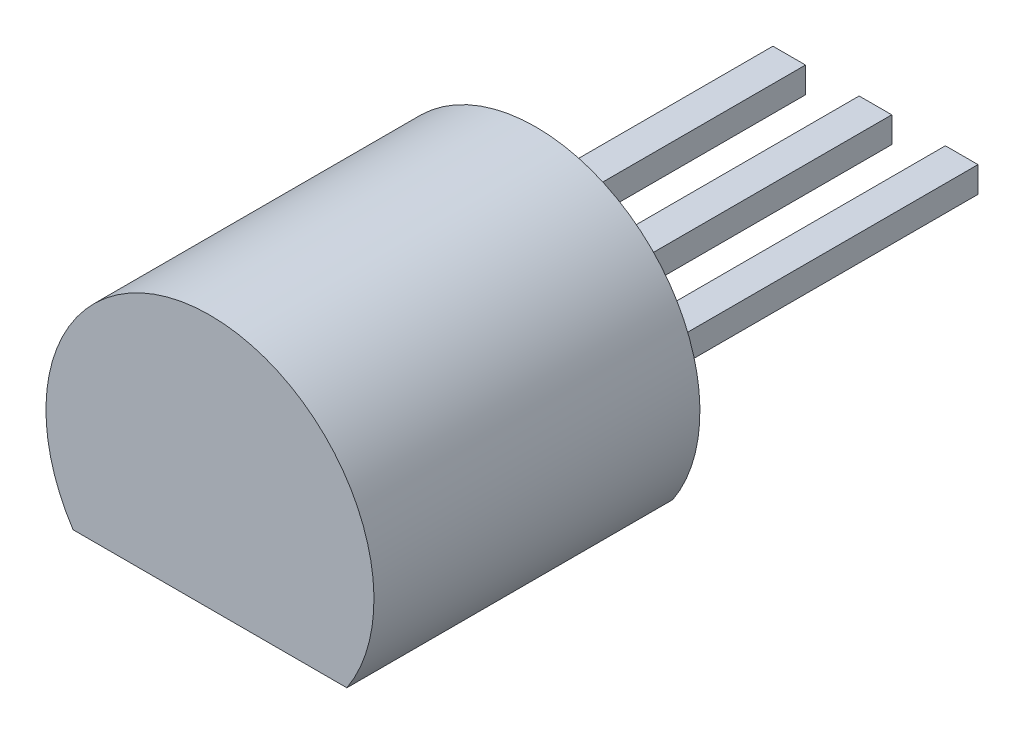
ISO-10303-21;
HEADER;
FILE_DESCRIPTION(('STEP AP214'),'2;1');
FILE_NAME('part.step','',(''),(''),'','','');
FILE_SCHEMA(('AUTOMOTIVE_DESIGN { 1 0 10303 214 1 1 1 1 }'));
ENDSEC;
DATA;
#1=APPLICATION_CONTEXT('core data for automotive mechanical design processes');
#2=APPLICATION_PROTOCOL_DEFINITION('international standard','automotive_design',2000,#1);
#3=PRODUCT_CONTEXT('',#1,'mechanical');
#4=PRODUCT('Part','Part','',(#3));
#5=PRODUCT_RELATED_PRODUCT_CATEGORY('part','',(#4));
#6=PRODUCT_DEFINITION_FORMATION('','',#4);
#7=PRODUCT_DEFINITION_CONTEXT('part definition',#1,'design');
#8=PRODUCT_DEFINITION('design','',#6,#7);
#9=PRODUCT_DEFINITION_SHAPE('','',#8);
#10=(LENGTH_UNIT() NAMED_UNIT(*) SI_UNIT(.MILLI.,.METRE.));
#11=(NAMED_UNIT(*) PLANE_ANGLE_UNIT() SI_UNIT($,.RADIAN.));
#12=(NAMED_UNIT(*) SI_UNIT($,.STERADIAN.) SOLID_ANGLE_UNIT());
#13=UNCERTAINTY_MEASURE_WITH_UNIT(LENGTH_MEASURE(1.E-05),#10,'distance_accuracy_value','');
#14=(GEOMETRIC_REPRESENTATION_CONTEXT(3) GLOBAL_UNCERTAINTY_ASSIGNED_CONTEXT((#13)) GLOBAL_UNIT_ASSIGNED_CONTEXT((#10,
#11,#12)) REPRESENTATION_CONTEXT('',''));
#15=CARTESIAN_POINT('',(0.,0.,0.));
#16=DIRECTION('',(0.,0.,1.));
#17=DIRECTION('',(1.,0.,0.));
#18=AXIS2_PLACEMENT_3D('',#15,#16,#17);
#19=CARTESIAN_POINT('',(1.51,0.19,2.5));
#20=DIRECTION('',(-1.,0.,0.));
#21=DIRECTION('',(0.,0.,1.));
#22=AXIS2_PLACEMENT_3D('',#19,#20,#21);
#23=PLANE('',#22);
#24=DIRECTION('',(0.,0.,1.));
#25=VECTOR('',#24,1.);
#26=CARTESIAN_POINT('',(1.51,-0.19,2.5));
#27=LINE('',#26,#25);
#28=CARTESIAN_POINT('',(1.51,-0.19,2.5));
#29=VERTEX_POINT('',#28);
#30=CARTESIAN_POINT('',(1.51,-0.19,-2.5));
#31=VERTEX_POINT('',#30);
#32=EDGE_CURVE('E125',#29,#31,#27,.F.);
#33=ORIENTED_EDGE('',*,*,#32,.T.);
#34=DIRECTION('',(0.,1.,0.));
#35=VECTOR('',#34,1.);
#36=CARTESIAN_POINT('',(1.51,0.19,-2.5));
#37=LINE('',#36,#35);
#38=CARTESIAN_POINT('',(1.51,0.19,-2.5));
#39=VERTEX_POINT('',#38);
#40=EDGE_CURVE('E227',#31,#39,#37,.T.);
#41=ORIENTED_EDGE('',*,*,#40,.T.);
#42=DIRECTION('',(0.,0.,-1.));
#43=VECTOR('',#42,1.);
#44=CARTESIAN_POINT('',(1.51,0.19,2.5));
#45=LINE('',#44,#43);
#46=CARTESIAN_POINT('',(1.51,0.19,2.5));
#47=VERTEX_POINT('',#46);
#48=EDGE_CURVE('E128',#39,#47,#45,.F.);
#49=ORIENTED_EDGE('',*,*,#48,.T.);
#50=DIRECTION('',(0.,1.,0.));
#51=VECTOR('',#50,1.);
#52=CARTESIAN_POINT('',(1.51,0.19,2.5));
#53=LINE('',#52,#51);
#54=EDGE_CURVE('E122',#29,#47,#53,.T.);
#55=ORIENTED_EDGE('',*,*,#54,.F.);
#56=EDGE_LOOP('',(#33,#41,#49,#55));
#57=FACE_BOUND('',#56,.T.);
#58=ADVANCED_FACE('F17',(#57),#23,.F.);
#59=CARTESIAN_POINT('',(0.24,0.19,2.5));
#60=DIRECTION('',(-1.,0.,0.));
#61=DIRECTION('',(0.,0.,1.));
#62=AXIS2_PLACEMENT_3D('',#59,#60,#61);
#63=PLANE('',#62);
#64=DIRECTION('',(0.,0.,1.));
#65=VECTOR('',#64,1.);
#66=CARTESIAN_POINT('',(0.24,-0.19,2.5));
#67=LINE('',#66,#65);
#68=CARTESIAN_POINT('',(0.24,-0.19,2.5));
#69=VERTEX_POINT('',#68);
#70=CARTESIAN_POINT('',(0.24,-0.19,-2.5));
#71=VERTEX_POINT('',#70);
#72=EDGE_CURVE('E219',#69,#71,#67,.F.);
#73=ORIENTED_EDGE('',*,*,#72,.T.);
#74=DIRECTION('',(0.,1.,0.));
#75=VECTOR('',#74,1.);
#76=CARTESIAN_POINT('',(0.24,0.19,-2.5));
#77=LINE('',#76,#75);
#78=CARTESIAN_POINT('',(0.24,0.19,-2.5));
#79=VERTEX_POINT('',#78);
#80=EDGE_CURVE('E211',#71,#79,#77,.T.);
#81=ORIENTED_EDGE('',*,*,#80,.T.);
#82=DIRECTION('',(0.,0.,-1.));
#83=VECTOR('',#82,1.);
#84=CARTESIAN_POINT('',(0.24,0.19,2.5));
#85=LINE('',#84,#83);
#86=CARTESIAN_POINT('',(0.24,0.19,2.5));
#87=VERTEX_POINT('',#86);
#88=EDGE_CURVE('E205',#79,#87,#85,.F.);
#89=ORIENTED_EDGE('',*,*,#88,.T.);
#90=DIRECTION('',(0.,1.,0.));
#91=VECTOR('',#90,1.);
#92=CARTESIAN_POINT('',(0.24,0.19,2.5));
#93=LINE('',#92,#91);
#94=EDGE_CURVE('E131',#69,#87,#93,.T.);
#95=ORIENTED_EDGE('',*,*,#94,.F.);
#96=EDGE_LOOP('',(#73,#81,#89,#95));
#97=FACE_BOUND('',#96,.T.);
#98=ADVANCED_FACE('F287',(#97),#63,.F.);
#99=CARTESIAN_POINT('',(2.3,0.19,2.5));
#100=DIRECTION('',(0.,-1.,0.));
#101=DIRECTION('',(0.,0.,-1.));
#102=AXIS2_PLACEMENT_3D('',#99,#100,#101);
#103=PLANE('',#102);
#104=DIRECTION('',(0.,0.,1.));
#105=VECTOR('',#104,1.);
#106=CARTESIAN_POINT('',(2.78,0.19,2.5));
#107=LINE('',#106,#105);
#108=CARTESIAN_POINT('',(2.78,0.19,2.5));
#109=VERTEX_POINT('',#108);
#110=CARTESIAN_POINT('',(2.78,0.19,-2.5));
#111=VERTEX_POINT('',#110);
#112=EDGE_CURVE('E201',#109,#111,#107,.F.);
#113=ORIENTED_EDGE('',*,*,#112,.T.);
#114=DIRECTION('',(1.,0.,0.));
#115=VECTOR('',#114,1.);
#116=CARTESIAN_POINT('',(2.3,0.19,-2.5));
#117=LINE('',#116,#115);
#118=CARTESIAN_POINT('',(2.3,0.19,-2.5));
#119=VERTEX_POINT('',#118);
#120=EDGE_CURVE('E193',#111,#119,#117,.F.);
#121=ORIENTED_EDGE('',*,*,#120,.T.);
#122=DIRECTION('',(0.,0.,-1.));
#123=VECTOR('',#122,1.);
#124=CARTESIAN_POINT('',(2.3,0.19,2.5));
#125=LINE('',#124,#123);
#126=CARTESIAN_POINT('',(2.3,0.19,2.5));
#127=VERTEX_POINT('',#126);
#128=EDGE_CURVE('E187',#119,#127,#125,.F.);
#129=ORIENTED_EDGE('',*,*,#128,.T.);
#130=DIRECTION('',(1.,0.,0.));
#131=VECTOR('',#130,1.);
#132=CARTESIAN_POINT('',(2.3,0.19,2.5));
#133=LINE('',#132,#131);
#134=EDGE_CURVE('E145',#109,#127,#133,.F.);
#135=ORIENTED_EDGE('',*,*,#134,.F.);
#136=EDGE_LOOP('',(#113,#121,#129,#135));
#137=FACE_BOUND('',#136,.T.);
#138=ADVANCED_FACE('F285',(#137),#103,.F.);
#139=CARTESIAN_POINT('',(1.51,-0.19,2.5));
#140=DIRECTION('',(0.,1.,0.));
#141=DIRECTION('',(0.,0.,1.));
#142=AXIS2_PLACEMENT_3D('',#139,#140,#141);
#143=PLANE('',#142);
#144=DIRECTION('',(0.,0.,-1.));
#145=VECTOR('',#144,1.);
#146=CARTESIAN_POINT('',(1.03,-0.19,2.5));
#147=LINE('',#146,#145);
#148=CARTESIAN_POINT('',(1.03,-0.19,2.5));
#149=VERTEX_POINT('',#148);
#150=CARTESIAN_POINT('',(1.03,-0.19,-2.5));
#151=VERTEX_POINT('',#150);
#152=EDGE_CURVE('E184',#149,#151,#147,.T.);
#153=ORIENTED_EDGE('',*,*,#152,.T.);
#154=DIRECTION('',(1.,0.,0.));
#155=VECTOR('',#154,1.);
#156=CARTESIAN_POINT('',(1.03,-0.19,-2.5));
#157=LINE('',#156,#155);
#158=EDGE_CURVE('E140',#151,#31,#157,.T.);
#159=ORIENTED_EDGE('',*,*,#158,.T.);
#160=ORIENTED_EDGE('',*,*,#32,.F.);
#161=DIRECTION('',(1.,0.,0.));
#162=VECTOR('',#161,1.);
#163=CARTESIAN_POINT('',(1.51,-0.19,2.5));
#164=LINE('',#163,#162);
#165=EDGE_CURVE('E134',#149,#29,#164,.T.);
#166=ORIENTED_EDGE('',*,*,#165,.F.);
#167=EDGE_LOOP('',(#153,#159,#160,#166));
#168=FACE_BOUND('',#167,.T.);
#169=ADVANCED_FACE('F142',(#168),#143,.F.);
#170=CARTESIAN_POINT('',(1.03,0.19,-2.5));
#171=DIRECTION('',(0.,0.,1.));
#172=DIRECTION('',(1.,0.,0.));
#173=AXIS2_PLACEMENT_3D('',#170,#171,#172);
#174=PLANE('',#173);
#175=ORIENTED_EDGE('',*,*,#40,.F.);
#176=ORIENTED_EDGE('',*,*,#158,.F.);
#177=DIRECTION('',(0.,1.,0.));
#178=VECTOR('',#177,1.);
#179=CARTESIAN_POINT('',(1.03,-0.19,-2.5));
#180=LINE('',#179,#178);
#181=CARTESIAN_POINT('',(1.03,0.19,-2.5));
#182=VERTEX_POINT('',#181);
#183=EDGE_CURVE('E182',#151,#182,#180,.T.);
#184=ORIENTED_EDGE('',*,*,#183,.T.);
#185=DIRECTION('',(1.,0.,0.));
#186=VECTOR('',#185,1.);
#187=CARTESIAN_POINT('',(1.03,0.19,-2.5));
#188=LINE('',#187,#186);
#189=EDGE_CURVE('E224',#182,#39,#188,.T.);
#190=ORIENTED_EDGE('',*,*,#189,.T.);
#191=EDGE_LOOP('',(#175,#176,#184,#190));
#192=FACE_BOUND('',#191,.T.);
#193=ADVANCED_FACE('F230',(#192),#174,.F.);
#194=CARTESIAN_POINT('',(1.03,0.19,2.5));
#195=DIRECTION('',(0.,-1.,0.));
#196=DIRECTION('',(0.,0.,-1.));
#197=AXIS2_PLACEMENT_3D('',#194,#195,#196);
#198=PLANE('',#197);
#199=ORIENTED_EDGE('',*,*,#48,.F.);
#200=ORIENTED_EDGE('',*,*,#189,.F.);
#201=DIRECTION('',(0.,0.,-1.));
#202=VECTOR('',#201,1.);
#203=CARTESIAN_POINT('',(1.03,0.19,2.5));
#204=LINE('',#203,#202);
#205=CARTESIAN_POINT('',(1.03,0.19,2.5));
#206=VERTEX_POINT('',#205);
#207=EDGE_CURVE('E179',#182,#206,#204,.F.);
#208=ORIENTED_EDGE('',*,*,#207,.T.);
#209=DIRECTION('',(1.,0.,0.));
#210=VECTOR('',#209,1.);
#211=CARTESIAN_POINT('',(1.03,0.19,2.5));
#212=LINE('',#211,#210);
#213=EDGE_CURVE('E221',#47,#206,#212,.F.);
#214=ORIENTED_EDGE('',*,*,#213,.F.);
#215=EDGE_LOOP('',(#199,#200,#208,#214));
#216=FACE_BOUND('',#215,.T.);
#217=ADVANCED_FACE('F234',(#216),#198,.F.);
#218=CARTESIAN_POINT('',(0.24,-0.19,2.5));
#219=DIRECTION('',(0.,1.,0.));
#220=DIRECTION('',(0.,0.,1.));
#221=AXIS2_PLACEMENT_3D('',#218,#219,#220);
#222=PLANE('',#221);
#223=DIRECTION('',(0.,0.,-1.));
#224=VECTOR('',#223,1.);
#225=CARTESIAN_POINT('',(-0.24,-0.19,2.5));
#226=LINE('',#225,#224);
#227=CARTESIAN_POINT('',(-0.24,-0.19,2.5));
#228=VERTEX_POINT('',#227);
#229=CARTESIAN_POINT('',(-0.24,-0.19,-2.5));
#230=VERTEX_POINT('',#229);
#231=EDGE_CURVE('E177',#228,#230,#226,.T.);
#232=ORIENTED_EDGE('',*,*,#231,.T.);
#233=DIRECTION('',(1.,0.,0.));
#234=VECTOR('',#233,1.);
#235=CARTESIAN_POINT('',(-0.24,-0.19,-2.5));
#236=LINE('',#235,#234);
#237=EDGE_CURVE('E213',#230,#71,#236,.T.);
#238=ORIENTED_EDGE('',*,*,#237,.T.);
#239=ORIENTED_EDGE('',*,*,#72,.F.);
#240=DIRECTION('',(1.,0.,0.));
#241=VECTOR('',#240,1.);
#242=CARTESIAN_POINT('',(0.24,-0.19,2.5));
#243=LINE('',#242,#241);
#244=EDGE_CURVE('E216',#228,#69,#243,.T.);
#245=ORIENTED_EDGE('',*,*,#244,.F.);
#246=EDGE_LOOP('',(#232,#238,#239,#245));
#247=FACE_BOUND('',#246,.T.);
#248=ADVANCED_FACE('F300',(#247),#222,.F.);
#249=CARTESIAN_POINT('',(-0.24,0.19,-2.5));
#250=DIRECTION('',(0.,0.,1.));
#251=DIRECTION('',(1.,0.,0.));
#252=AXIS2_PLACEMENT_3D('',#249,#250,#251);
#253=PLANE('',#252);
#254=ORIENTED_EDGE('',*,*,#80,.F.);
#255=ORIENTED_EDGE('',*,*,#237,.F.);
#256=DIRECTION('',(0.,1.,0.));
#257=VECTOR('',#256,1.);
#258=CARTESIAN_POINT('',(-0.24,-0.19,-2.5));
#259=LINE('',#258,#257);
#260=CARTESIAN_POINT('',(-0.24,0.19,-2.5));
#261=VERTEX_POINT('',#260);
#262=EDGE_CURVE('E175',#230,#261,#259,.T.);
#263=ORIENTED_EDGE('',*,*,#262,.T.);
#264=DIRECTION('',(1.,0.,0.));
#265=VECTOR('',#264,1.);
#266=CARTESIAN_POINT('',(-0.24,0.19,-2.5));
#267=LINE('',#266,#265);
#268=EDGE_CURVE('E208',#261,#79,#267,.T.);
#269=ORIENTED_EDGE('',*,*,#268,.T.);
#270=EDGE_LOOP('',(#254,#255,#263,#269));
#271=FACE_BOUND('',#270,.T.);
#272=ADVANCED_FACE('F303',(#271),#253,.F.);
#273=CARTESIAN_POINT('',(-0.24,0.19,2.5));
#274=DIRECTION('',(0.,-1.,0.));
#275=DIRECTION('',(0.,0.,-1.));
#276=AXIS2_PLACEMENT_3D('',#273,#274,#275);
#277=PLANE('',#276);
#278=ORIENTED_EDGE('',*,*,#88,.F.);
#279=ORIENTED_EDGE('',*,*,#268,.F.);
#280=DIRECTION('',(0.,0.,-1.));
#281=VECTOR('',#280,1.);
#282=CARTESIAN_POINT('',(-0.24,0.19,2.5));
#283=LINE('',#282,#281);
#284=CARTESIAN_POINT('',(-0.24,0.19,2.5));
#285=VERTEX_POINT('',#284);
#286=EDGE_CURVE('E172',#261,#285,#283,.F.);
#287=ORIENTED_EDGE('',*,*,#286,.T.);
#288=DIRECTION('',(1.,0.,0.));
#289=VECTOR('',#288,1.);
#290=CARTESIAN_POINT('',(-0.24,0.19,2.5));
#291=LINE('',#290,#289);
#292=EDGE_CURVE('E203',#87,#285,#291,.F.);
#293=ORIENTED_EDGE('',*,*,#292,.F.);
#294=EDGE_LOOP('',(#278,#279,#287,#293));
#295=FACE_BOUND('',#294,.T.);
#296=ADVANCED_FACE('F307',(#295),#277,.F.);
#297=CARTESIAN_POINT('',(2.78,0.19,2.5));
#298=DIRECTION('',(-1.,0.,0.));
#299=DIRECTION('',(0.,0.,1.));
#300=AXIS2_PLACEMENT_3D('',#297,#298,#299);
#301=PLANE('',#300);
#302=DIRECTION('',(0.,0.,1.));
#303=VECTOR('',#302,1.);
#304=CARTESIAN_POINT('',(2.78,-0.19,2.5));
#305=LINE('',#304,#303);
#306=CARTESIAN_POINT('',(2.78,-0.19,2.5));
#307=VERTEX_POINT('',#306);
#308=CARTESIAN_POINT('',(2.78,-0.19,-2.5));
#309=VERTEX_POINT('',#308);
#310=EDGE_CURVE('E170',#307,#309,#305,.F.);
#311=ORIENTED_EDGE('',*,*,#310,.T.);
#312=DIRECTION('',(0.,1.,0.));
#313=VECTOR('',#312,1.);
#314=CARTESIAN_POINT('',(2.78,0.19,-2.5));
#315=LINE('',#314,#313);
#316=EDGE_CURVE('E195',#309,#111,#315,.T.);
#317=ORIENTED_EDGE('',*,*,#316,.T.);
#318=ORIENTED_EDGE('',*,*,#112,.F.);
#319=DIRECTION('',(0.,1.,0.));
#320=VECTOR('',#319,1.);
#321=CARTESIAN_POINT('',(2.78,0.19,2.5));
#322=LINE('',#321,#320);
#323=EDGE_CURVE('E198',#307,#109,#322,.T.);
#324=ORIENTED_EDGE('',*,*,#323,.F.);
#325=EDGE_LOOP('',(#311,#317,#318,#324));
#326=FACE_BOUND('',#325,.T.);
#327=ADVANCED_FACE('F282',(#326),#301,.F.);
#328=CARTESIAN_POINT('',(2.3,0.19,-2.5));
#329=DIRECTION('',(0.,0.,1.));
#330=DIRECTION('',(1.,0.,0.));
#331=AXIS2_PLACEMENT_3D('',#328,#329,#330);
#332=PLANE('',#331);
#333=ORIENTED_EDGE('',*,*,#316,.F.);
#334=DIRECTION('',(1.,0.,0.));
#335=VECTOR('',#334,1.);
#336=CARTESIAN_POINT('',(2.78,-0.19,-2.5));
#337=LINE('',#336,#335);
#338=CARTESIAN_POINT('',(2.3,-0.19,-2.5));
#339=VERTEX_POINT('',#338);
#340=EDGE_CURVE('E168',#309,#339,#337,.F.);
#341=ORIENTED_EDGE('',*,*,#340,.T.);
#342=DIRECTION('',(0.,1.,0.));
#343=VECTOR('',#342,1.);
#344=CARTESIAN_POINT('',(2.3,-0.19,-2.5));
#345=LINE('',#344,#343);
#346=EDGE_CURVE('E190',#339,#119,#345,.T.);
#347=ORIENTED_EDGE('',*,*,#346,.T.);
#348=ORIENTED_EDGE('',*,*,#120,.F.);
#349=EDGE_LOOP('',(#333,#341,#347,#348));
#350=FACE_BOUND('',#349,.T.);
#351=ADVANCED_FACE('F249',(#350),#332,.F.);
#352=CARTESIAN_POINT('',(2.3,-0.19,2.5));
#353=DIRECTION('',(1.,0.,0.));
#354=DIRECTION('',(0.,0.,-1.));
#355=AXIS2_PLACEMENT_3D('',#352,#353,#354);
#356=PLANE('',#355);
#357=ORIENTED_EDGE('',*,*,#128,.F.);
#358=ORIENTED_EDGE('',*,*,#346,.F.);
#359=DIRECTION('',(0.,0.,1.));
#360=VECTOR('',#359,1.);
#361=CARTESIAN_POINT('',(2.3,-0.19,2.5));
#362=LINE('',#361,#360);
#363=CARTESIAN_POINT('',(2.3,-0.19,2.5));
#364=VERTEX_POINT('',#363);
#365=EDGE_CURVE('E166',#339,#364,#362,.T.);
#366=ORIENTED_EDGE('',*,*,#365,.T.);
#367=DIRECTION('',(0.,1.,0.));
#368=VECTOR('',#367,1.);
#369=CARTESIAN_POINT('',(2.3,-0.19,2.5));
#370=LINE('',#369,#368);
#371=EDGE_CURVE('E52',#127,#364,#370,.F.);
#372=ORIENTED_EDGE('',*,*,#371,.F.);
#373=EDGE_LOOP('',(#357,#358,#366,#372));
#374=FACE_BOUND('',#373,.T.);
#375=ADVANCED_FACE('F239',(#374),#356,.F.);
#376=CARTESIAN_POINT('',(1.03,-0.19,2.5));
#377=DIRECTION('',(1.,0.,0.));
#378=DIRECTION('',(0.,0.,-1.));
#379=AXIS2_PLACEMENT_3D('',#376,#377,#378);
#380=PLANE('',#379);
#381=ORIENTED_EDGE('',*,*,#207,.F.);
#382=ORIENTED_EDGE('',*,*,#183,.F.);
#383=ORIENTED_EDGE('',*,*,#152,.F.);
#384=DIRECTION('',(0.,1.,0.));
#385=VECTOR('',#384,1.);
#386=CARTESIAN_POINT('',(1.03,-1.33,2.5));
#387=LINE('',#386,#385);
#388=EDGE_CURVE('E137',#206,#149,#387,.F.);
#389=ORIENTED_EDGE('',*,*,#388,.F.);
#390=EDGE_LOOP('',(#381,#382,#383,#389));
#391=FACE_BOUND('',#390,.T.);
#392=ADVANCED_FACE('F236',(#391),#380,.F.);
#393=CARTESIAN_POINT('',(-0.24,-0.19,2.5));
#394=DIRECTION('',(1.,0.,0.));
#395=DIRECTION('',(0.,0.,-1.));
#396=AXIS2_PLACEMENT_3D('',#393,#394,#395);
#397=PLANE('',#396);
#398=ORIENTED_EDGE('',*,*,#286,.F.);
#399=ORIENTED_EDGE('',*,*,#262,.F.);
#400=ORIENTED_EDGE('',*,*,#231,.F.);
#401=DIRECTION('',(0.,1.,0.));
#402=VECTOR('',#401,1.);
#403=CARTESIAN_POINT('',(-0.24,-1.33,2.5));
#404=LINE('',#403,#402);
#405=EDGE_CURVE('E162',#285,#228,#404,.F.);
#406=ORIENTED_EDGE('',*,*,#405,.F.);
#407=EDGE_LOOP('',(#398,#399,#400,#406));
#408=FACE_BOUND('',#407,.T.);
#409=ADVANCED_FACE('F238',(#408),#397,.F.);
#410=CARTESIAN_POINT('',(2.78,-0.19,2.5));
#411=DIRECTION('',(0.,1.,0.));
#412=DIRECTION('',(0.,0.,1.));
#413=AXIS2_PLACEMENT_3D('',#410,#411,#412);
#414=PLANE('',#413);
#415=ORIENTED_EDGE('',*,*,#365,.F.);
#416=ORIENTED_EDGE('',*,*,#340,.F.);
#417=ORIENTED_EDGE('',*,*,#310,.F.);
#418=DIRECTION('',(-1.,0.,0.));
#419=VECTOR('',#418,1.);
#420=CARTESIAN_POINT('',(-0.745769083998,-0.19,2.5));
#421=LINE('',#420,#419);
#422=EDGE_CURVE('E159',#364,#307,#421,.F.);
#423=ORIENTED_EDGE('',*,*,#422,.F.);
#424=EDGE_LOOP('',(#415,#416,#417,#423));
#425=FACE_BOUND('',#424,.T.);
#426=ADVANCED_FACE('F246',(#425),#414,.F.);
#427=CARTESIAN_POINT('',(-0.745769083998,-1.33,2.5));
#428=DIRECTION('',(0.,0.,-1.));
#429=DIRECTION('',(-1.,0.,0.));
#430=AXIS2_PLACEMENT_3D('',#427,#428,#429);
#431=PLANE('',#430);
#432=ORIENTED_EDGE('',*,*,#371,.T.);
#433=ORIENTED_EDGE('',*,*,#422,.T.);
#434=ORIENTED_EDGE('',*,*,#323,.T.);
#435=ORIENTED_EDGE('',*,*,#134,.T.);
#436=EDGE_LOOP('',(#432,#433,#434,#435));
#437=FACE_BOUND('',#436,.T.);
#438=ORIENTED_EDGE('',*,*,#292,.T.);
#439=ORIENTED_EDGE('',*,*,#405,.T.);
#440=ORIENTED_EDGE('',*,*,#244,.T.);
#441=ORIENTED_EDGE('',*,*,#94,.T.);
#442=EDGE_LOOP('',(#438,#439,#440,#441));
#443=FACE_BOUND('',#442,.T.);
#444=ORIENTED_EDGE('',*,*,#213,.T.);
#445=ORIENTED_EDGE('',*,*,#388,.T.);
#446=ORIENTED_EDGE('',*,*,#165,.T.);
#447=ORIENTED_EDGE('',*,*,#54,.T.);
#448=EDGE_LOOP('',(#444,#445,#446,#447));
#449=FACE_BOUND('',#448,.T.);
#450=DIRECTION('',(1.,0.,0.));
#451=VECTOR('',#450,1.);
#452=CARTESIAN_POINT('',(-0.745769083998,-1.33,2.5));
#453=LINE('',#452,#451);
#454=CARTESIAN_POINT('',(3.28576908399755,-1.32999999999988,2.5));
#455=VERTEX_POINT('',#454);
#456=CARTESIAN_POINT('',(-0.74576908399755,-1.32999999999988,2.5));
#457=VERTEX_POINT('',#456);
#458=EDGE_CURVE('E156',#455,#457,#453,.F.);
#459=ORIENTED_EDGE('',*,*,#458,.T.);
#460=CARTESIAN_POINT('',(1.27,0.,2.5));
#461=DIRECTION('',(0.,0.,-1.));
#462=DIRECTION('',(-1.,0.,0.));
#463=AXIS2_PLACEMENT_3D('',#460,#461,#462);
#464=CIRCLE('',#463,2.415);
#465=EDGE_CURVE('E20',#455,#457,#464,.F.);
#466=ORIENTED_EDGE('',*,*,#465,.F.);
#467=EDGE_LOOP('',(#459,#466));
#468=FACE_BOUND('',#467,.T.);
#469=ADVANCED_FACE('F135',(#437,#443,#449,#468),#431,.T.);
#470=CARTESIAN_POINT('',(-0.745769083998,-1.33,7.3));
#471=DIRECTION('',(0.,0.,-1.));
#472=DIRECTION('',(-1.,0.,0.));
#473=AXIS2_PLACEMENT_3D('',#470,#471,#472);
#474=PLANE('',#473);
#475=CARTESIAN_POINT('',(1.27,0.,7.3));
#476=DIRECTION('',(0.,0.,-1.));
#477=DIRECTION('',(-1.,0.,0.));
#478=AXIS2_PLACEMENT_3D('',#475,#476,#477);
#479=CIRCLE('',#478,2.415);
#480=CARTESIAN_POINT('',(-0.74576908399755,-1.32999999999988,7.3));
#481=VERTEX_POINT('',#480);
#482=CARTESIAN_POINT('',(3.28576908399755,-1.32999999999988,7.3));
#483=VERTEX_POINT('',#482);
#484=EDGE_CURVE('E26',#481,#483,#479,.T.);
#485=ORIENTED_EDGE('',*,*,#484,.F.);
#486=DIRECTION('',(1.,0.,0.));
#487=VECTOR('',#486,1.);
#488=CARTESIAN_POINT('',(-0.745769083998,-1.33,7.3));
#489=LINE('',#488,#487);
#490=EDGE_CURVE('E34',#481,#483,#489,.T.);
#491=ORIENTED_EDGE('',*,*,#490,.T.);
#492=EDGE_LOOP('',(#485,#491));
#493=FACE_BOUND('',#492,.T.);
#494=ADVANCED_FACE('F259',(#493),#474,.F.);
#495=CARTESIAN_POINT('',(-0.745769083998,-1.33,2.5));
#496=DIRECTION('',(0.,1.,0.));
#497=DIRECTION('',(0.,0.,1.));
#498=AXIS2_PLACEMENT_3D('',#495,#496,#497);
#499=PLANE('',#498);
#500=DIRECTION('',(0.,0.,-1.));
#501=VECTOR('',#500,1.);
#502=CARTESIAN_POINT('',(3.28576908399763,-1.32999999999976,2.5));
#503=LINE('',#502,#501);
#504=EDGE_CURVE('E11',#483,#455,#503,.T.);
#505=ORIENTED_EDGE('',*,*,#504,.F.);
#506=ORIENTED_EDGE('',*,*,#490,.F.);
#507=DIRECTION('',(0.,0.,-1.));
#508=VECTOR('',#507,1.);
#509=CARTESIAN_POINT('',(-0.745769083997631,-1.32999999999976,2.5));
#510=LINE('',#509,#508);
#511=EDGE_CURVE('E151',#457,#481,#510,.F.);
#512=ORIENTED_EDGE('',*,*,#511,.F.);
#513=ORIENTED_EDGE('',*,*,#458,.F.);
#514=EDGE_LOOP('',(#505,#506,#512,#513));
#515=FACE_BOUND('',#514,.T.);
#516=ADVANCED_FACE('F254',(#515),#499,.F.);
#517=CARTESIAN_POINT('',(1.27,0.,2.5));
#518=DIRECTION('',(0.,0.,-1.));
#519=DIRECTION('',(-1.,0.,0.));
#520=AXIS2_PLACEMENT_3D('',#517,#518,#519);
#521=CYLINDRICAL_SURFACE('',#520,2.415);
#522=ORIENTED_EDGE('',*,*,#484,.T.);
#523=ORIENTED_EDGE('',*,*,#504,.T.);
#524=ORIENTED_EDGE('',*,*,#465,.T.);
#525=ORIENTED_EDGE('',*,*,#511,.T.);
#526=EDGE_LOOP('',(#522,#523,#524,#525));
#527=FACE_BOUND('',#526,.T.);
#528=ADVANCED_FACE('F252',(#527),#521,.T.);
#529=CLOSED_SHELL('',(#58,#98,#138,#169,#193,#217,#248,#272,#296,#327,#351,#375,#392,#409,#426,
#469,#494,#516,#528));
#530=MANIFOLD_SOLID_BREP('B1',#529);
#531=ADVANCED_BREP_SHAPE_REPRESENTATION('',(#18,#530),#14);
#532=SHAPE_DEFINITION_REPRESENTATION(#9,#531);
ENDSEC;
END-ISO-10303-21;
